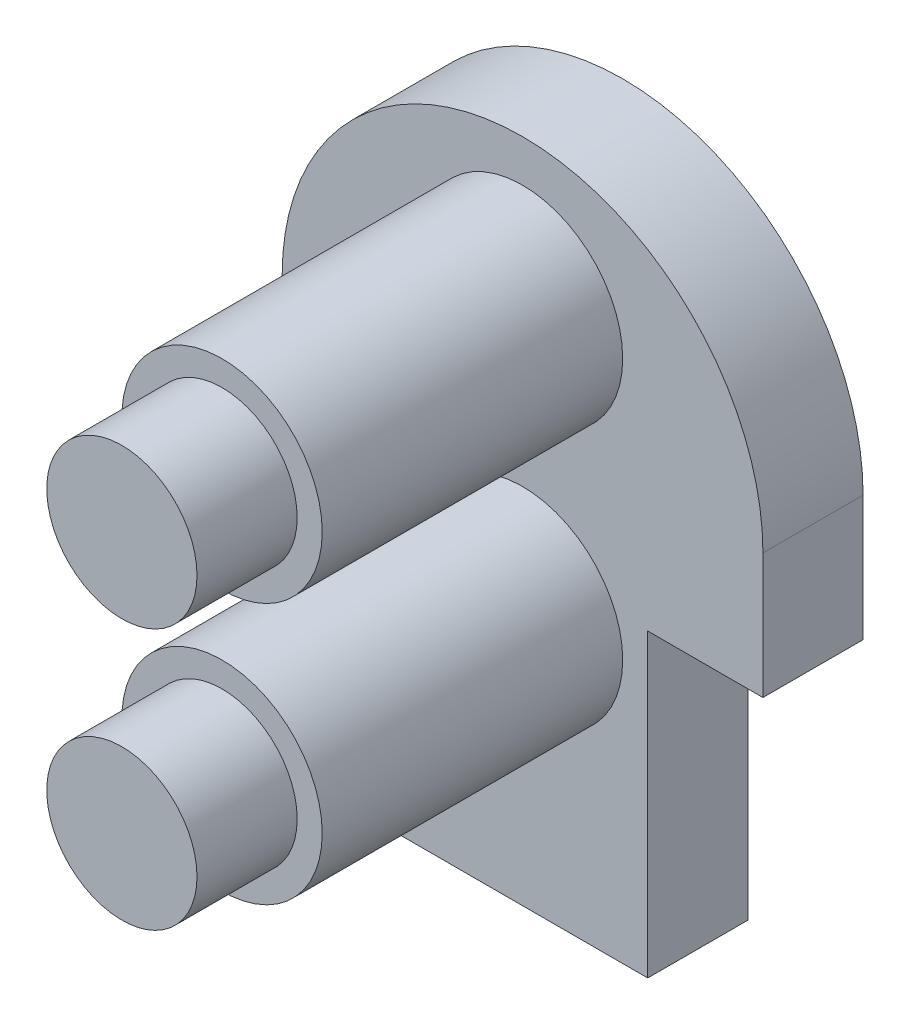
ISO-10303-21;
HEADER;
FILE_DESCRIPTION(('STEP AP214'),'2;1');
FILE_NAME('part.step','',(''),(''),'','','');
FILE_SCHEMA(('AUTOMOTIVE_DESIGN { 1 0 10303 214 1 1 1 1 }'));
ENDSEC;
DATA;
#1=APPLICATION_CONTEXT('core data for automotive mechanical design processes');
#2=APPLICATION_PROTOCOL_DEFINITION('international standard','automotive_design',2000,#1);
#3=PRODUCT_CONTEXT('',#1,'mechanical');
#4=PRODUCT('Part','Part','',(#3));
#5=PRODUCT_RELATED_PRODUCT_CATEGORY('part','',(#4));
#6=PRODUCT_DEFINITION_FORMATION('','',#4);
#7=PRODUCT_DEFINITION_CONTEXT('part definition',#1,'design');
#8=PRODUCT_DEFINITION('design','',#6,#7);
#9=PRODUCT_DEFINITION_SHAPE('','',#8);
#10=(LENGTH_UNIT() NAMED_UNIT(*) SI_UNIT(.MILLI.,.METRE.));
#11=(NAMED_UNIT(*) PLANE_ANGLE_UNIT() SI_UNIT($,.RADIAN.));
#12=(NAMED_UNIT(*) SI_UNIT($,.STERADIAN.) SOLID_ANGLE_UNIT());
#13=UNCERTAINTY_MEASURE_WITH_UNIT(LENGTH_MEASURE(1.E-05),#10,'distance_accuracy_value','');
#14=(GEOMETRIC_REPRESENTATION_CONTEXT(3) GLOBAL_UNCERTAINTY_ASSIGNED_CONTEXT((#13)) GLOBAL_UNIT_ASSIGNED_CONTEXT((#10,
#11,#12)) REPRESENTATION_CONTEXT('',''));
#15=CARTESIAN_POINT('',(0.,0.,0.));
#16=DIRECTION('',(0.,0.,1.));
#17=DIRECTION('',(1.,0.,0.));
#18=AXIS2_PLACEMENT_3D('',#15,#16,#17);
#19=CARTESIAN_POINT('',(5.,20.9211723588727,16.));
#20=DIRECTION('',(0.,0.,1.));
#21=DIRECTION('',(1.,0.,0.));
#22=AXIS2_PLACEMENT_3D('',#19,#20,#21);
#23=PLANE('',#22);
#24=CARTESIAN_POINT('',(5.,20.9211723588727,16.));
#25=DIRECTION('',(0.,0.,1.));
#26=DIRECTION('',(1.,0.,0.));
#27=AXIS2_PLACEMENT_3D('',#24,#25,#26);
#28=CIRCLE('',#27,4.);
#29=CARTESIAN_POINT('',(9.,20.9211723588727,16.));
#30=VERTEX_POINT('',#29);
#31=EDGE_CURVE('E183',#30,#30,#28,.T.);
#32=ORIENTED_EDGE('',*,*,#31,.T.);
#33=EDGE_LOOP('',(#32));
#34=FACE_BOUND('',#33,.T.);
#35=CARTESIAN_POINT('',(5.,20.9211723588727,16.));
#36=DIRECTION('',(0.,0.,1.));
#37=DIRECTION('',(1.,0.,0.));
#38=AXIS2_PLACEMENT_3D('',#35,#36,#37);
#39=CIRCLE('',#38,3.);
#40=CARTESIAN_POINT('',(8.,20.9211723588727,16.));
#41=VERTEX_POINT('',#40);
#42=EDGE_CURVE('E199',#41,#41,#39,.T.);
#43=ORIENTED_EDGE('',*,*,#42,.F.);
#44=EDGE_LOOP('',(#43));
#45=FACE_BOUND('',#44,.T.);
#46=ADVANCED_FACE('F32',(#34,#45),#23,.T.);
#47=CARTESIAN_POINT('',(5.,10.5,16.));
#48=DIRECTION('',(0.,0.,1.));
#49=DIRECTION('',(1.,0.,0.));
#50=AXIS2_PLACEMENT_3D('',#47,#48,#49);
#51=PLANE('',#50);
#52=CARTESIAN_POINT('',(5.,10.5,16.));
#53=DIRECTION('',(0.,0.,1.));
#54=DIRECTION('',(1.,0.,0.));
#55=AXIS2_PLACEMENT_3D('',#52,#53,#54);
#56=CIRCLE('',#55,4.);
#57=CARTESIAN_POINT('',(9.,10.5,16.));
#58=VERTEX_POINT('',#57);
#59=EDGE_CURVE('E189',#58,#58,#56,.T.);
#60=ORIENTED_EDGE('',*,*,#59,.T.);
#61=EDGE_LOOP('',(#60));
#62=FACE_BOUND('',#61,.T.);
#63=CARTESIAN_POINT('',(5.,10.5,16.));
#64=DIRECTION('',(0.,0.,1.));
#65=DIRECTION('',(1.,0.,0.));
#66=AXIS2_PLACEMENT_3D('',#63,#64,#65);
#67=CIRCLE('',#66,3.);
#68=CARTESIAN_POINT('',(8.,10.5,16.));
#69=VERTEX_POINT('',#68);
#70=EDGE_CURVE('E193',#69,#69,#67,.T.);
#71=ORIENTED_EDGE('',*,*,#70,.F.);
#72=EDGE_LOOP('',(#71));
#73=FACE_BOUND('',#72,.T.);
#74=ADVANCED_FACE('F215',(#62,#73),#51,.T.);
#75=CARTESIAN_POINT('',(5.,17.,4.));
#76=DIRECTION('',(0.,0.,1.));
#77=DIRECTION('',(1.,0.,0.));
#78=AXIS2_PLACEMENT_3D('',#75,#76,#77);
#79=PLANE('',#78);
#80=CARTESIAN_POINT('',(5.,20.9211723588727,4.));
#81=DIRECTION('',(0.,0.,1.));
#82=DIRECTION('',(1.,0.,0.));
#83=AXIS2_PLACEMENT_3D('',#80,#81,#82);
#84=CIRCLE('',#83,4.);
#85=CARTESIAN_POINT('',(9.,20.9211723588727,4.));
#86=VERTEX_POINT('',#85);
#87=EDGE_CURVE('E138',#86,#86,#84,.F.);
#88=ORIENTED_EDGE('',*,*,#87,.T.);
#89=EDGE_LOOP('',(#88));
#90=FACE_BOUND('',#89,.T.);
#91=DIRECTION('',(0.,1.,0.));
#92=VECTOR('',#91,1.);
#93=CARTESIAN_POINT('',(10.,0.,4.));
#94=LINE('',#93,#92);
#95=CARTESIAN_POINT('',(10.,0.,4.));
#96=VERTEX_POINT('',#95);
#97=CARTESIAN_POINT('',(10.,12.,4.));
#98=VERTEX_POINT('',#97);
#99=EDGE_CURVE('E162',#96,#98,#94,.T.);
#100=ORIENTED_EDGE('',*,*,#99,.T.);
#101=DIRECTION('',(1.,0.,0.));
#102=VECTOR('',#101,1.);
#103=CARTESIAN_POINT('',(10.,12.,4.));
#104=LINE('',#103,#102);
#105=CARTESIAN_POINT('',(14.6,12.,4.));
#106=VERTEX_POINT('',#105);
#107=EDGE_CURVE('E175',#98,#106,#104,.T.);
#108=ORIENTED_EDGE('',*,*,#107,.T.);
#109=DIRECTION('',(0.,1.,0.));
#110=VECTOR('',#109,1.);
#111=CARTESIAN_POINT('',(14.6,12.,4.));
#112=LINE('',#111,#110);
#113=CARTESIAN_POINT('',(14.6,17.,4.));
#114=VERTEX_POINT('',#113);
#115=EDGE_CURVE('E114',#106,#114,#112,.T.);
#116=ORIENTED_EDGE('',*,*,#115,.T.);
#117=CARTESIAN_POINT('',(5.,17.,4.));
#118=DIRECTION('',(0.,0.,1.));
#119=DIRECTION('',(1.,0.,0.));
#120=AXIS2_PLACEMENT_3D('',#117,#118,#119);
#121=CIRCLE('',#120,9.6);
#122=CARTESIAN_POINT('',(-4.6,17.,4.));
#123=VERTEX_POINT('',#122);
#124=EDGE_CURVE('E107',#114,#123,#121,.T.);
#125=ORIENTED_EDGE('',*,*,#124,.T.);
#126=DIRECTION('',(0.,-1.,0.));
#127=VECTOR('',#126,1.);
#128=CARTESIAN_POINT('',(-4.6,12.,4.));
#129=LINE('',#128,#127);
#130=CARTESIAN_POINT('',(-4.6,12.,4.));
#131=VERTEX_POINT('',#130);
#132=EDGE_CURVE('E112',#123,#131,#129,.T.);
#133=ORIENTED_EDGE('',*,*,#132,.T.);
#134=DIRECTION('',(1.,0.,0.));
#135=VECTOR('',#134,1.);
#136=CARTESIAN_POINT('',(0.,12.,4.));
#137=LINE('',#136,#135);
#138=CARTESIAN_POINT('',(0.,12.,4.));
#139=VERTEX_POINT('',#138);
#140=EDGE_CURVE('E128',#131,#139,#137,.T.);
#141=ORIENTED_EDGE('',*,*,#140,.T.);
#142=DIRECTION('',(0.,-1.,0.));
#143=VECTOR('',#142,1.);
#144=CARTESIAN_POINT('',(0.,0.,4.));
#145=LINE('',#144,#143);
#146=CARTESIAN_POINT('',(0.,0.,4.));
#147=VERTEX_POINT('',#146);
#148=EDGE_CURVE('E49',#139,#147,#145,.T.);
#149=ORIENTED_EDGE('',*,*,#148,.T.);
#150=DIRECTION('',(1.,0.,0.));
#151=VECTOR('',#150,1.);
#152=CARTESIAN_POINT('',(0.,0.,4.));
#153=LINE('',#152,#151);
#154=EDGE_CURVE('E93',#147,#96,#153,.T.);
#155=ORIENTED_EDGE('',*,*,#154,.T.);
#156=EDGE_LOOP('',(#100,#108,#116,#125,#133,#141,#149,#155));
#157=FACE_BOUND('',#156,.T.);
#158=CARTESIAN_POINT('',(5.,10.5,4.));
#159=DIRECTION('',(0.,0.,1.));
#160=DIRECTION('',(1.,0.,0.));
#161=AXIS2_PLACEMENT_3D('',#158,#159,#160);
#162=CIRCLE('',#161,4.);
#163=CARTESIAN_POINT('',(9.,10.5,4.));
#164=VERTEX_POINT('',#163);
#165=EDGE_CURVE('E186',#164,#164,#162,.F.);
#166=ORIENTED_EDGE('',*,*,#165,.T.);
#167=EDGE_LOOP('',(#166));
#168=FACE_BOUND('',#167,.T.);
#169=ADVANCED_FACE('F109',(#90,#157,#168),#79,.T.);
#170=CARTESIAN_POINT('',(0.,0.,4.));
#171=DIRECTION('',(0.,1.,0.));
#172=DIRECTION('',(0.,0.,1.));
#173=AXIS2_PLACEMENT_3D('',#170,#171,#172);
#174=PLANE('',#173);
#175=DIRECTION('',(1.,0.,0.));
#176=VECTOR('',#175,1.);
#177=CARTESIAN_POINT('',(0.,0.,0.));
#178=LINE('',#177,#176);
#179=CARTESIAN_POINT('',(0.,0.,0.));
#180=VERTEX_POINT('',#179);
#181=CARTESIAN_POINT('',(10.,0.,0.));
#182=VERTEX_POINT('',#181);
#183=EDGE_CURVE('E134',#180,#182,#178,.T.);
#184=ORIENTED_EDGE('',*,*,#183,.T.);
#185=DIRECTION('',(0.,0.,-1.));
#186=VECTOR('',#185,1.);
#187=CARTESIAN_POINT('',(10.,0.,4.));
#188=LINE('',#187,#186);
#189=EDGE_CURVE('E41',#96,#182,#188,.T.);
#190=ORIENTED_EDGE('',*,*,#189,.F.);
#191=ORIENTED_EDGE('',*,*,#154,.F.);
#192=DIRECTION('',(0.,0.,-1.));
#193=VECTOR('',#192,1.);
#194=CARTESIAN_POINT('',(0.,0.,4.));
#195=LINE('',#194,#193);
#196=EDGE_CURVE('E11',#147,#180,#195,.T.);
#197=ORIENTED_EDGE('',*,*,#196,.T.);
#198=EDGE_LOOP('',(#184,#190,#191,#197));
#199=FACE_BOUND('',#198,.T.);
#200=ADVANCED_FACE('F34',(#199),#174,.F.);
#201=CARTESIAN_POINT('',(10.,8.,4.));
#202=DIRECTION('',(-1.,0.,0.));
#203=DIRECTION('',(0.,0.,1.));
#204=AXIS2_PLACEMENT_3D('',#201,#202,#203);
#205=PLANE('',#204);
#206=DIRECTION('',(0.,1.,0.));
#207=VECTOR('',#206,1.);
#208=CARTESIAN_POINT('',(10.,8.,0.));
#209=LINE('',#208,#207);
#210=CARTESIAN_POINT('',(10.,12.,0.));
#211=VERTEX_POINT('',#210);
#212=EDGE_CURVE('E137',#182,#211,#209,.T.);
#213=ORIENTED_EDGE('',*,*,#212,.T.);
#214=DIRECTION('',(0.,0.,-1.));
#215=VECTOR('',#214,1.);
#216=CARTESIAN_POINT('',(10.,12.,4.));
#217=LINE('',#216,#215);
#218=EDGE_CURVE('E155',#98,#211,#217,.T.);
#219=ORIENTED_EDGE('',*,*,#218,.F.);
#220=ORIENTED_EDGE('',*,*,#99,.F.);
#221=ORIENTED_EDGE('',*,*,#189,.T.);
#222=EDGE_LOOP('',(#213,#219,#220,#221));
#223=FACE_BOUND('',#222,.T.);
#224=ADVANCED_FACE('F160',(#223),#205,.F.);
#225=CARTESIAN_POINT('',(10.,12.,4.));
#226=DIRECTION('',(0.,1.,0.));
#227=DIRECTION('',(0.,0.,1.));
#228=AXIS2_PLACEMENT_3D('',#225,#226,#227);
#229=PLANE('',#228);
#230=DIRECTION('',(1.,0.,0.));
#231=VECTOR('',#230,1.);
#232=CARTESIAN_POINT('',(10.,12.,0.));
#233=LINE('',#232,#231);
#234=CARTESIAN_POINT('',(14.6,12.,0.));
#235=VERTEX_POINT('',#234);
#236=EDGE_CURVE('E140',#211,#235,#233,.T.);
#237=ORIENTED_EDGE('',*,*,#236,.T.);
#238=DIRECTION('',(0.,0.,-1.));
#239=VECTOR('',#238,1.);
#240=CARTESIAN_POINT('',(14.6,12.,4.));
#241=LINE('',#240,#239);
#242=EDGE_CURVE('E152',#106,#235,#241,.T.);
#243=ORIENTED_EDGE('',*,*,#242,.F.);
#244=ORIENTED_EDGE('',*,*,#107,.F.);
#245=ORIENTED_EDGE('',*,*,#218,.T.);
#246=EDGE_LOOP('',(#237,#243,#244,#245));
#247=FACE_BOUND('',#246,.T.);
#248=ADVANCED_FACE('F171',(#247),#229,.F.);
#249=CARTESIAN_POINT('',(14.6,12.,4.));
#250=DIRECTION('',(-1.,0.,0.));
#251=DIRECTION('',(0.,0.,1.));
#252=AXIS2_PLACEMENT_3D('',#249,#250,#251);
#253=PLANE('',#252);
#254=DIRECTION('',(0.,1.,0.));
#255=VECTOR('',#254,1.);
#256=CARTESIAN_POINT('',(14.6,12.,0.));
#257=LINE('',#256,#255);
#258=CARTESIAN_POINT('',(14.6,17.,0.));
#259=VERTEX_POINT('',#258);
#260=EDGE_CURVE('E142',#235,#259,#257,.T.);
#261=ORIENTED_EDGE('',*,*,#260,.T.);
#262=DIRECTION('',(0.,0.,-1.));
#263=VECTOR('',#262,1.);
#264=CARTESIAN_POINT('',(14.6,17.,4.));
#265=LINE('',#264,#263);
#266=EDGE_CURVE('E123',#114,#259,#265,.T.);
#267=ORIENTED_EDGE('',*,*,#266,.F.);
#268=ORIENTED_EDGE('',*,*,#115,.F.);
#269=ORIENTED_EDGE('',*,*,#242,.T.);
#270=EDGE_LOOP('',(#261,#267,#268,#269));
#271=FACE_BOUND('',#270,.T.);
#272=ADVANCED_FACE('F174',(#271),#253,.F.);
#273=CARTESIAN_POINT('',(5.,17.,4.));
#274=DIRECTION('',(0.,0.,-1.));
#275=DIRECTION('',(-1.,0.,0.));
#276=AXIS2_PLACEMENT_3D('',#273,#274,#275);
#277=CYLINDRICAL_SURFACE('',#276,9.6);
#278=CARTESIAN_POINT('',(5.,17.,0.));
#279=DIRECTION('',(0.,0.,1.));
#280=DIRECTION('',(1.,0.,0.));
#281=AXIS2_PLACEMENT_3D('',#278,#279,#280);
#282=CIRCLE('',#281,9.6);
#283=CARTESIAN_POINT('',(-4.6,17.,0.));
#284=VERTEX_POINT('',#283);
#285=EDGE_CURVE('E122',#259,#284,#282,.T.);
#286=ORIENTED_EDGE('',*,*,#285,.T.);
#287=DIRECTION('',(0.,0.,-1.));
#288=VECTOR('',#287,1.);
#289=CARTESIAN_POINT('',(-4.6,17.,4.));
#290=LINE('',#289,#288);
#291=EDGE_CURVE('E119',#123,#284,#290,.T.);
#292=ORIENTED_EDGE('',*,*,#291,.F.);
#293=ORIENTED_EDGE('',*,*,#124,.F.);
#294=ORIENTED_EDGE('',*,*,#266,.T.);
#295=EDGE_LOOP('',(#286,#292,#293,#294));
#296=FACE_BOUND('',#295,.T.);
#297=ADVANCED_FACE('F120',(#296),#277,.T.);
#298=CARTESIAN_POINT('',(-4.6,12.,4.));
#299=DIRECTION('',(1.,0.,0.));
#300=DIRECTION('',(0.,0.,-1.));
#301=AXIS2_PLACEMENT_3D('',#298,#299,#300);
#302=PLANE('',#301);
#303=DIRECTION('',(0.,-1.,0.));
#304=VECTOR('',#303,1.);
#305=CARTESIAN_POINT('',(-4.6,12.,0.));
#306=LINE('',#305,#304);
#307=CARTESIAN_POINT('',(-4.6,12.,0.));
#308=VERTEX_POINT('',#307);
#309=EDGE_CURVE('E79',#284,#308,#306,.T.);
#310=ORIENTED_EDGE('',*,*,#309,.T.);
#311=DIRECTION('',(0.,0.,-1.));
#312=VECTOR('',#311,1.);
#313=CARTESIAN_POINT('',(-4.6,12.,4.));
#314=LINE('',#313,#312);
#315=EDGE_CURVE('E124',#131,#308,#314,.T.);
#316=ORIENTED_EDGE('',*,*,#315,.F.);
#317=ORIENTED_EDGE('',*,*,#132,.F.);
#318=ORIENTED_EDGE('',*,*,#291,.T.);
#319=EDGE_LOOP('',(#310,#316,#317,#318));
#320=FACE_BOUND('',#319,.T.);
#321=ADVANCED_FACE('F126',(#320),#302,.F.);
#322=CARTESIAN_POINT('',(0.,12.,4.));
#323=DIRECTION('',(0.,1.,0.));
#324=DIRECTION('',(0.,0.,1.));
#325=AXIS2_PLACEMENT_3D('',#322,#323,#324);
#326=PLANE('',#325);
#327=DIRECTION('',(1.,0.,0.));
#328=VECTOR('',#327,1.);
#329=CARTESIAN_POINT('',(0.,12.,0.));
#330=LINE('',#329,#328);
#331=CARTESIAN_POINT('',(0.,12.,0.));
#332=VERTEX_POINT('',#331);
#333=EDGE_CURVE('E86',#308,#332,#330,.T.);
#334=ORIENTED_EDGE('',*,*,#333,.T.);
#335=DIRECTION('',(0.,0.,-1.));
#336=VECTOR('',#335,1.);
#337=CARTESIAN_POINT('',(0.,12.,4.));
#338=LINE('',#337,#336);
#339=EDGE_CURVE('E130',#139,#332,#338,.T.);
#340=ORIENTED_EDGE('',*,*,#339,.F.);
#341=ORIENTED_EDGE('',*,*,#140,.F.);
#342=ORIENTED_EDGE('',*,*,#315,.T.);
#343=EDGE_LOOP('',(#334,#340,#341,#342));
#344=FACE_BOUND('',#343,.T.);
#345=ADVANCED_FACE('F238',(#344),#326,.F.);
#346=CARTESIAN_POINT('',(0.,8.,4.));
#347=DIRECTION('',(1.,0.,0.));
#348=DIRECTION('',(0.,0.,-1.));
#349=AXIS2_PLACEMENT_3D('',#346,#347,#348);
#350=PLANE('',#349);
#351=DIRECTION('',(0.,-1.,0.));
#352=VECTOR('',#351,1.);
#353=CARTESIAN_POINT('',(0.,8.,0.));
#354=LINE('',#353,#352);
#355=EDGE_CURVE('E147',#332,#180,#354,.T.);
#356=ORIENTED_EDGE('',*,*,#355,.T.);
#357=ORIENTED_EDGE('',*,*,#196,.F.);
#358=ORIENTED_EDGE('',*,*,#148,.F.);
#359=ORIENTED_EDGE('',*,*,#339,.T.);
#360=EDGE_LOOP('',(#356,#357,#358,#359));
#361=FACE_BOUND('',#360,.T.);
#362=ADVANCED_FACE('F235',(#361),#350,.F.);
#363=CARTESIAN_POINT('',(5.,17.,0.));
#364=DIRECTION('',(0.,0.,1.));
#365=DIRECTION('',(1.,0.,0.));
#366=AXIS2_PLACEMENT_3D('',#363,#364,#365);
#367=PLANE('',#366);
#368=ORIENTED_EDGE('',*,*,#212,.F.);
#369=ORIENTED_EDGE('',*,*,#183,.F.);
#370=ORIENTED_EDGE('',*,*,#355,.F.);
#371=ORIENTED_EDGE('',*,*,#333,.F.);
#372=ORIENTED_EDGE('',*,*,#309,.F.);
#373=ORIENTED_EDGE('',*,*,#285,.F.);
#374=ORIENTED_EDGE('',*,*,#260,.F.);
#375=ORIENTED_EDGE('',*,*,#236,.F.);
#376=EDGE_LOOP('',(#368,#369,#370,#371,#372,#373,#374,#375));
#377=FACE_BOUND('',#376,.T.);
#378=ADVANCED_FACE('F166',(#377),#367,.F.);
#379=CARTESIAN_POINT('',(5.,20.9211723588727,16.));
#380=DIRECTION('',(0.,0.,-1.));
#381=DIRECTION('',(-1.,0.,0.));
#382=AXIS2_PLACEMENT_3D('',#379,#380,#381);
#383=CYLINDRICAL_SURFACE('',#382,4.);
#384=ORIENTED_EDGE('',*,*,#87,.F.);
#385=EDGE_LOOP('',(#384));
#386=FACE_BOUND('',#385,.T.);
#387=ORIENTED_EDGE('',*,*,#31,.F.);
#388=EDGE_LOOP('',(#387));
#389=FACE_BOUND('',#388,.T.);
#390=ADVANCED_FACE('F226',(#386,#389),#383,.T.);
#391=CARTESIAN_POINT('',(5.,10.5,16.));
#392=DIRECTION('',(0.,0.,-1.));
#393=DIRECTION('',(-1.,0.,0.));
#394=AXIS2_PLACEMENT_3D('',#391,#392,#393);
#395=CYLINDRICAL_SURFACE('',#394,4.);
#396=ORIENTED_EDGE('',*,*,#165,.F.);
#397=EDGE_LOOP('',(#396));
#398=FACE_BOUND('',#397,.T.);
#399=ORIENTED_EDGE('',*,*,#59,.F.);
#400=EDGE_LOOP('',(#399));
#401=FACE_BOUND('',#400,.T.);
#402=ADVANCED_FACE('F225',(#398,#401),#395,.T.);
#403=CARTESIAN_POINT('',(5.,10.5,20.));
#404=DIRECTION('',(0.,0.,-1.));
#405=DIRECTION('',(-1.,0.,0.));
#406=AXIS2_PLACEMENT_3D('',#403,#404,#405);
#407=CYLINDRICAL_SURFACE('',#406,3.);
#408=CARTESIAN_POINT('',(5.,10.5,20.));
#409=DIRECTION('',(0.,0.,1.));
#410=DIRECTION('',(1.,0.,0.));
#411=AXIS2_PLACEMENT_3D('',#408,#409,#410);
#412=CIRCLE('',#411,3.);
#413=CARTESIAN_POINT('',(8.,10.5,20.));
#414=VERTEX_POINT('',#413);
#415=EDGE_CURVE('E192',#414,#414,#412,.T.);
#416=ORIENTED_EDGE('',*,*,#415,.F.);
#417=EDGE_LOOP('',(#416));
#418=FACE_BOUND('',#417,.T.);
#419=ORIENTED_EDGE('',*,*,#70,.T.);
#420=EDGE_LOOP('',(#419));
#421=FACE_BOUND('',#420,.T.);
#422=ADVANCED_FACE('F274',(#418,#421),#407,.T.);
#423=CARTESIAN_POINT('',(5.,10.5,20.));
#424=DIRECTION('',(0.,0.,1.));
#425=DIRECTION('',(1.,0.,0.));
#426=AXIS2_PLACEMENT_3D('',#423,#424,#425);
#427=PLANE('',#426);
#428=ORIENTED_EDGE('',*,*,#415,.T.);
#429=EDGE_LOOP('',(#428));
#430=FACE_BOUND('',#429,.T.);
#431=ADVANCED_FACE('F210',(#430),#427,.T.);
#432=CARTESIAN_POINT('',(5.,20.9211723588727,20.));
#433=DIRECTION('',(0.,0.,-1.));
#434=DIRECTION('',(-1.,0.,0.));
#435=AXIS2_PLACEMENT_3D('',#432,#433,#434);
#436=CYLINDRICAL_SURFACE('',#435,3.);
#437=CARTESIAN_POINT('',(5.,20.9211723588727,20.));
#438=DIRECTION('',(0.,0.,1.));
#439=DIRECTION('',(1.,0.,0.));
#440=AXIS2_PLACEMENT_3D('',#437,#438,#439);
#441=CIRCLE('',#440,3.);
#442=CARTESIAN_POINT('',(8.,20.9211723588727,20.));
#443=VERTEX_POINT('',#442);
#444=EDGE_CURVE('E196',#443,#443,#441,.T.);
#445=ORIENTED_EDGE('',*,*,#444,.F.);
#446=EDGE_LOOP('',(#445));
#447=FACE_BOUND('',#446,.T.);
#448=ORIENTED_EDGE('',*,*,#42,.T.);
#449=EDGE_LOOP('',(#448));
#450=FACE_BOUND('',#449,.T.);
#451=ADVANCED_FACE('F207',(#447,#450),#436,.T.);
#452=CARTESIAN_POINT('',(5.,20.9211723588727,20.));
#453=DIRECTION('',(0.,0.,1.));
#454=DIRECTION('',(1.,0.,0.));
#455=AXIS2_PLACEMENT_3D('',#452,#453,#454);
#456=PLANE('',#455);
#457=ORIENTED_EDGE('',*,*,#444,.T.);
#458=EDGE_LOOP('',(#457));
#459=FACE_BOUND('',#458,.T.);
#460=ADVANCED_FACE('F205',(#459),#456,.T.);
#461=CLOSED_SHELL('',(#46,#74,#169,#200,#224,#248,#272,#297,#321,#345,#362,#378,#390,#402,#422,
#431,#451,#460));
#462=MANIFOLD_SOLID_BREP('B2',#461);
#463=ADVANCED_BREP_SHAPE_REPRESENTATION('',(#18,#462),#14);
#464=SHAPE_DEFINITION_REPRESENTATION(#9,#463);
ENDSEC;
END-ISO-10303-21;
